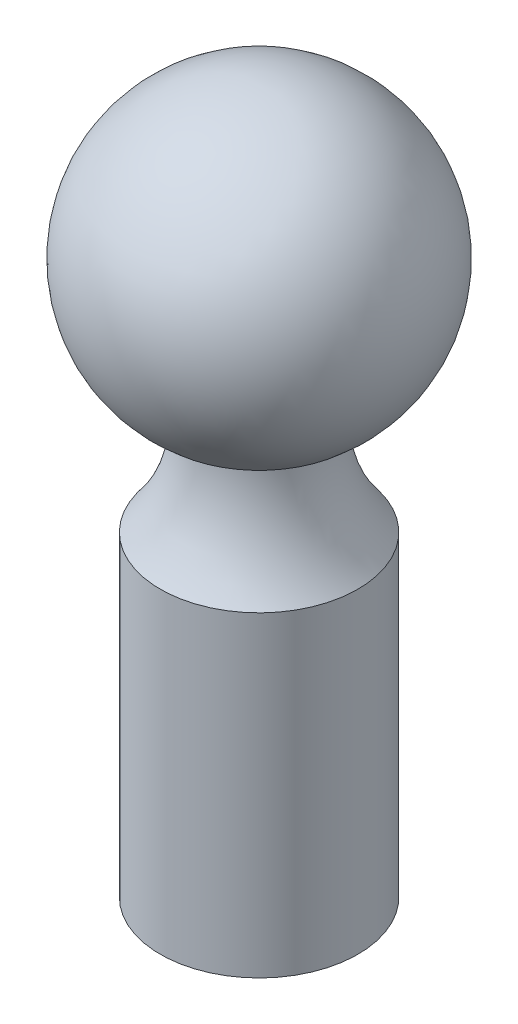
ISO-10303-21;
HEADER;
FILE_DESCRIPTION(('STEP AP214'),'2;1');
FILE_NAME('part.step','',(''),(''),'','','');
FILE_SCHEMA(('AUTOMOTIVE_DESIGN { 1 0 10303 214 1 1 1 1 }'));
ENDSEC;
DATA;
#1=APPLICATION_CONTEXT('core data for automotive mechanical design processes');
#2=APPLICATION_PROTOCOL_DEFINITION('international standard','automotive_design',2000,#1);
#3=PRODUCT_CONTEXT('',#1,'mechanical');
#4=PRODUCT('Part','Part','',(#3));
#5=PRODUCT_RELATED_PRODUCT_CATEGORY('part','',(#4));
#6=PRODUCT_DEFINITION_FORMATION('','',#4);
#7=PRODUCT_DEFINITION_CONTEXT('part definition',#1,'design');
#8=PRODUCT_DEFINITION('design','',#6,#7);
#9=PRODUCT_DEFINITION_SHAPE('','',#8);
#10=(LENGTH_UNIT() NAMED_UNIT(*) SI_UNIT(.MILLI.,.METRE.));
#11=(NAMED_UNIT(*) PLANE_ANGLE_UNIT() SI_UNIT($,.RADIAN.));
#12=(NAMED_UNIT(*) SI_UNIT($,.STERADIAN.) SOLID_ANGLE_UNIT());
#13=UNCERTAINTY_MEASURE_WITH_UNIT(LENGTH_MEASURE(1.E-05),#10,'distance_accuracy_value','');
#14=(GEOMETRIC_REPRESENTATION_CONTEXT(3) GLOBAL_UNCERTAINTY_ASSIGNED_CONTEXT((#13)) GLOBAL_UNIT_ASSIGNED_CONTEXT((#10,
#11,#12)) REPRESENTATION_CONTEXT('',''));
#15=CARTESIAN_POINT('',(0.,0.,0.));
#16=DIRECTION('',(0.,0.,1.));
#17=DIRECTION('',(1.,0.,0.));
#18=AXIS2_PLACEMENT_3D('',#15,#16,#17);
#19=CARTESIAN_POINT('',(0.,-15.,0.));
#20=DIRECTION('',(0.,1.,0.));
#21=DIRECTION('',(0.,0.,1.));
#22=AXIS2_PLACEMENT_3D('',#19,#20,#21);
#23=CYLINDRICAL_SURFACE('',#22,4.);
#24=CARTESIAN_POINT('',(0.,-8.68038767011773,0.));
#25=DIRECTION('',(0.,-1.,0.));
#26=DIRECTION('',(0.,0.,-1.));
#27=AXIS2_PLACEMENT_3D('',#24,#25,#26);
#28=CIRCLE('',#27,4.);
#29=CARTESIAN_POINT('',(0.,-8.68038767011773,-4.));
#30=VERTEX_POINT('',#29);
#31=EDGE_CURVE('E10',#30,#30,#28,.F.);
#32=ORIENTED_EDGE('',*,*,#31,.T.);
#33=EDGE_LOOP('',(#32));
#34=FACE_BOUND('',#33,.T.);
#35=CARTESIAN_POINT('',(0.,-8.61684396980704,0.));
#36=DIRECTION('',(0.,1.,0.));
#37=DIRECTION('',(0.,0.,1.));
#38=AXIS2_PLACEMENT_3D('',#35,#36,#37);
#39=CIRCLE('',#38,4.);
#40=CARTESIAN_POINT('',(0.,-8.61684396980704,4.));
#41=VERTEX_POINT('',#40);
#42=EDGE_CURVE('E49',#41,#41,#39,.T.);
#43=ORIENTED_EDGE('',*,*,#42,.F.);
#44=EDGE_LOOP('',(#43));
#45=FACE_BOUND('',#44,.T.);
#46=ADVANCED_FACE('F41',(#34,#45),#23,.T.);
#47=CARTESIAN_POINT('',(0.,0.,0.));
#48=DIRECTION('',(0.,-1.,0.));
#49=DIRECTION('',(-1.,0.,0.));
#50=AXIS2_PLACEMENT_3D('',#47,#48,#49);
#51=SPHERICAL_SURFACE('',#50,9.5);
#52=ORIENTED_EDGE('',*,*,#42,.T.);
#53=EDGE_LOOP('',(#52));
#54=FACE_BOUND('',#53,.T.);
#55=ADVANCED_FACE('F77',(#54),#51,.T.);
#56=CARTESIAN_POINT('',(0.,-35.,0.));
#57=DIRECTION('',(0.,1.,0.));
#58=DIRECTION('',(0.,0.,1.));
#59=AXIS2_PLACEMENT_3D('',#56,#57,#58);
#60=CYLINDRICAL_SURFACE('',#59,6.25);
#61=CARTESIAN_POINT('',(0.,-35.,0.));
#62=DIRECTION('',(0.,-1.,0.));
#63=DIRECTION('',(0.,0.,-1.));
#64=AXIS2_PLACEMENT_3D('',#61,#62,#63);
#65=CIRCLE('',#64,6.25);
#66=CARTESIAN_POINT('',(0.,-35.,-6.25));
#67=VERTEX_POINT('',#66);
#68=EDGE_CURVE('E54',#67,#67,#65,.T.);
#69=ORIENTED_EDGE('',*,*,#68,.F.);
#70=EDGE_LOOP('',(#69));
#71=FACE_BOUND('',#70,.T.);
#72=CARTESIAN_POINT('',(0.,-15.,0.));
#73=DIRECTION('',(0.,-1.,0.));
#74=DIRECTION('',(0.,0.,-1.));
#75=AXIS2_PLACEMENT_3D('',#72,#73,#74);
#76=CIRCLE('',#75,6.25);
#77=CARTESIAN_POINT('',(0.,-15.,-6.25));
#78=VERTEX_POINT('',#77);
#79=EDGE_CURVE('E59',#78,#78,#76,.T.);
#80=ORIENTED_EDGE('',*,*,#79,.T.);
#81=EDGE_LOOP('',(#80));
#82=FACE_BOUND('',#81,.T.);
#83=ADVANCED_FACE('F66',(#71,#82),#60,.T.);
#84=CARTESIAN_POINT('',(0.,-35.,0.));
#85=DIRECTION('',(0.,-1.,0.));
#86=DIRECTION('',(0.,0.,-1.));
#87=AXIS2_PLACEMENT_3D('',#84,#85,#86);
#88=PLANE('',#87);
#89=ORIENTED_EDGE('',*,*,#68,.T.);
#90=EDGE_LOOP('',(#89));
#91=FACE_BOUND('',#90,.T.);
#92=ADVANCED_FACE('F70',(#91),#88,.T.);
#93=CARTESIAN_POINT('',(0.,-8.68038767011773,0.));
#94=DIRECTION('',(0.,-1.,0.));
#95=DIRECTION('',(0.,0.,-1.));
#96=AXIS2_PLACEMENT_3D('',#93,#94,#95);
#97=TOROIDAL_SURFACE('',#96,14.,10.);
#98=ORIENTED_EDGE('',*,*,#79,.F.);
#99=EDGE_LOOP('',(#98));
#100=FACE_BOUND('',#99,.T.);
#101=ORIENTED_EDGE('',*,*,#31,.F.);
#102=EDGE_LOOP('',(#101));
#103=FACE_BOUND('',#102,.T.);
#104=ADVANCED_FACE('F43',(#100,#103),#97,.F.);
#105=CLOSED_SHELL('',(#46,#55,#83,#92,#104));
#106=MANIFOLD_SOLID_BREP('B2',#105);
#107=ADVANCED_BREP_SHAPE_REPRESENTATION('',(#18,#106),#14);
#108=SHAPE_DEFINITION_REPRESENTATION(#9,#107);
ENDSEC;
END-ISO-10303-21;
